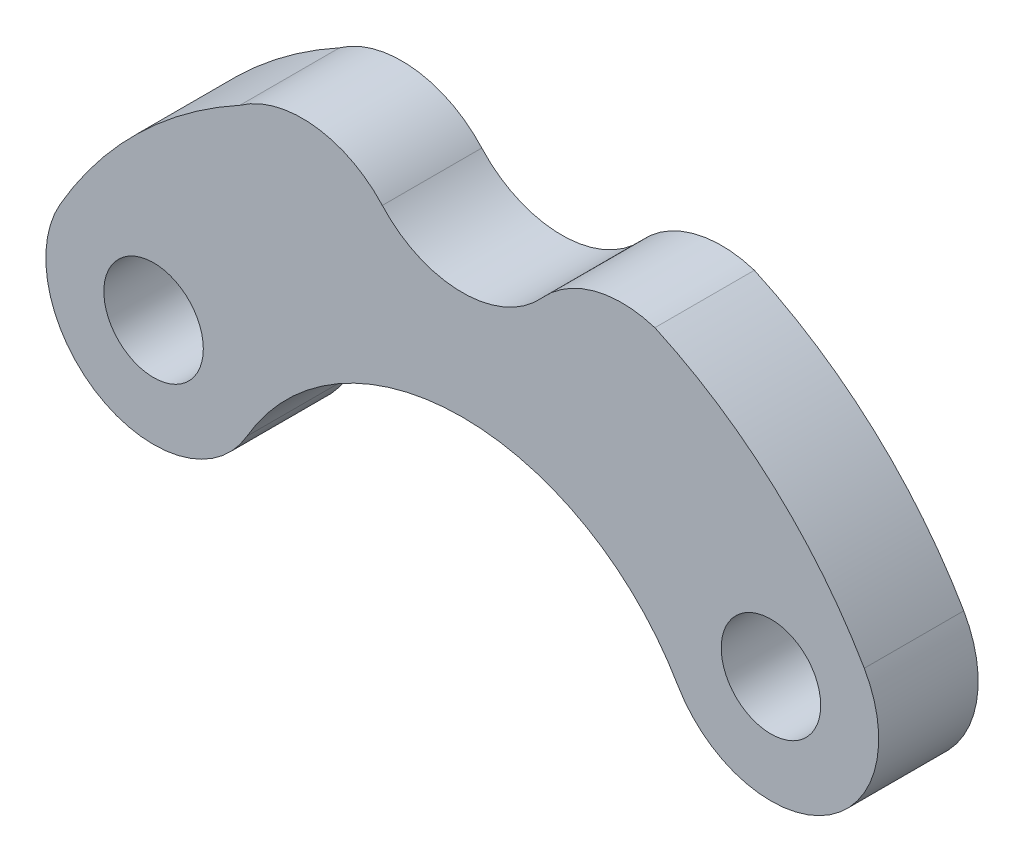
ISO-10303-21;
HEADER;
FILE_DESCRIPTION(('STEP AP214'),'2;1');
FILE_NAME('part.step','',(''),(''),'','','');
FILE_SCHEMA(('AUTOMOTIVE_DESIGN { 1 0 10303 214 1 1 1 1 }'));
ENDSEC;
DATA;
#1=APPLICATION_CONTEXT('core data for automotive mechanical design processes');
#2=APPLICATION_PROTOCOL_DEFINITION('international standard','automotive_design',2000,#1);
#3=PRODUCT_CONTEXT('',#1,'mechanical');
#4=PRODUCT('Part','Part','',(#3));
#5=PRODUCT_RELATED_PRODUCT_CATEGORY('part','',(#4));
#6=PRODUCT_DEFINITION_FORMATION('','',#4);
#7=PRODUCT_DEFINITION_CONTEXT('part definition',#1,'design');
#8=PRODUCT_DEFINITION('design','',#6,#7);
#9=PRODUCT_DEFINITION_SHAPE('','',#8);
#10=(LENGTH_UNIT() NAMED_UNIT(*) SI_UNIT(.MILLI.,.METRE.));
#11=(NAMED_UNIT(*) PLANE_ANGLE_UNIT() SI_UNIT($,.RADIAN.));
#12=(NAMED_UNIT(*) SI_UNIT($,.STERADIAN.) SOLID_ANGLE_UNIT());
#13=UNCERTAINTY_MEASURE_WITH_UNIT(LENGTH_MEASURE(1.E-05),#10,'distance_accuracy_value','');
#14=(GEOMETRIC_REPRESENTATION_CONTEXT(3) GLOBAL_UNCERTAINTY_ASSIGNED_CONTEXT((#13)) GLOBAL_UNIT_ASSIGNED_CONTEXT((#10,
#11,#12)) REPRESENTATION_CONTEXT('',''));
#15=CARTESIAN_POINT('',(0.,0.,0.));
#16=DIRECTION('',(0.,0.,1.));
#17=DIRECTION('',(1.,0.,0.));
#18=AXIS2_PLACEMENT_3D('',#15,#16,#17);
#19=CARTESIAN_POINT('',(-4.65488654534138,2.68749999999995,3.));
#20=DIRECTION('',(0.,0.,1.));
#21=DIRECTION('',(1.,0.,0.));
#22=AXIS2_PLACEMENT_3D('',#19,#20,#21);
#23=PLANE('',#22);
#24=CARTESIAN_POINT('',(9.30977309068262,5.37500000000016,3.));
#25=DIRECTION('',(0.,0.,1.));
#26=DIRECTION('',(1.,0.,0.));
#27=AXIS2_PLACEMENT_3D('',#24,#25,#26);
#28=CIRCLE('',#27,1.5);
#29=CARTESIAN_POINT('',(10.8097730906826,5.37500000000016,3.));
#30=VERTEX_POINT('',#29);
#31=EDGE_CURVE('E134',#30,#30,#28,.T.);
#32=ORIENTED_EDGE('',*,*,#31,.F.);
#33=EDGE_LOOP('',(#32));
#34=FACE_BOUND('',#33,.T.);
#35=CARTESIAN_POINT('',(-9.30977309068277,5.37499999999991,3.));
#36=DIRECTION('',(0.,0.,1.));
#37=DIRECTION('',(1.,0.,0.));
#38=AXIS2_PLACEMENT_3D('',#35,#36,#37);
#39=CIRCLE('',#38,3.25);
#40=CARTESIAN_POINT('',(-12.1243556529822,6.99999999999988,3.));
#41=VERTEX_POINT('',#40);
#42=CARTESIAN_POINT('',(-6.49519052838333,3.74999999999994,3.));
#43=VERTEX_POINT('',#42);
#44=EDGE_CURVE('E145',#41,#43,#39,.T.);
#45=ORIENTED_EDGE('',*,*,#44,.T.);
#46=CARTESIAN_POINT('',(0.,0.,3.));
#47=DIRECTION('',(0.,0.,-1.));
#48=DIRECTION('',(1.,0.,0.));
#49=AXIS2_PLACEMENT_3D('',#46,#47,#48);
#50=CIRCLE('',#49,7.5);
#51=CARTESIAN_POINT('',(6.49519052838322,3.75000000000011,3.));
#52=VERTEX_POINT('',#51);
#53=EDGE_CURVE('E93',#43,#52,#50,.T.);
#54=ORIENTED_EDGE('',*,*,#53,.T.);
#55=CARTESIAN_POINT('',(9.30977309068262,5.37500000000016,3.));
#56=DIRECTION('',(0.,0.,1.));
#57=DIRECTION('',(1.,0.,0.));
#58=AXIS2_PLACEMENT_3D('',#55,#56,#57);
#59=CIRCLE('',#58,3.25);
#60=CARTESIAN_POINT('',(12.124355652982,7.00000000000021,3.));
#61=VERTEX_POINT('',#60);
#62=EDGE_CURVE('E160',#52,#61,#59,.T.);
#63=ORIENTED_EDGE('',*,*,#62,.T.);
#64=CARTESIAN_POINT('',(0.,0.,3.));
#65=DIRECTION('',(0.,0.,1.));
#66=DIRECTION('',(1.,0.,0.));
#67=AXIS2_PLACEMENT_3D('',#64,#65,#66);
#68=CIRCLE('',#67,14.);
#69=CARTESIAN_POINT('',(5.80943087987062,12.7377593340432,3.));
#70=VERTEX_POINT('',#69);
#71=EDGE_CURVE('E173',#61,#70,#68,.T.);
#72=ORIENTED_EDGE('',*,*,#71,.T.);
#73=CARTESIAN_POINT('',(4.82206978136234,9.64137142857136,3.));
#74=DIRECTION('',(0.,0.,1.));
#75=DIRECTION('',(1.,0.,0.));
#76=AXIS2_PLACEMENT_3D('',#73,#74,#75);
#77=CIRCLE('',#76,3.25);
#78=CARTESIAN_POINT('',(2.41103489067909,11.8206857142833,3.));
#79=VERTEX_POINT('',#78);
#80=EDGE_CURVE('E112',#70,#79,#77,.T.);
#81=ORIENTED_EDGE('',*,*,#80,.T.);
#82=CARTESIAN_POINT('',(1.07437023516552E-11,13.9999999999817,3.));
#83=DIRECTION('',(0.,0.,-1.));
#84=DIRECTION('',(1.,0.,0.));
#85=AXIS2_PLACEMENT_3D('',#82,#83,#84);
#86=CIRCLE('',#85,3.24999999997992);
#87=CARTESIAN_POINT('',(-2.41103489066096,11.820685714287,3.));
#88=VERTEX_POINT('',#87);
#89=EDGE_CURVE('E106',#79,#88,#86,.T.);
#90=ORIENTED_EDGE('',*,*,#89,.T.);
#91=CARTESIAN_POINT('',(-4.82206978134755,9.64137142857876,3.));
#92=DIRECTION('',(0.,0.,1.));
#93=DIRECTION('',(1.,0.,0.));
#94=AXIS2_PLACEMENT_3D('',#91,#92,#93);
#95=CIRCLE('',#94,3.25);
#96=CARTESIAN_POINT('',(-6.70737151186402,12.2886601141799,3.));
#97=VERTEX_POINT('',#96);
#98=EDGE_CURVE('E110',#88,#97,#95,.T.);
#99=ORIENTED_EDGE('',*,*,#98,.T.);
#100=CARTESIAN_POINT('',(0.,0.,3.));
#101=DIRECTION('',(0.,0.,1.));
#102=DIRECTION('',(1.,0.,0.));
#103=AXIS2_PLACEMENT_3D('',#100,#101,#102);
#104=CIRCLE('',#103,14.);
#105=EDGE_CURVE('E50',#97,#41,#104,.T.);
#106=ORIENTED_EDGE('',*,*,#105,.T.);
#107=EDGE_LOOP('',(#45,#54,#63,#72,#81,#90,#99,#106));
#108=FACE_BOUND('',#107,.T.);
#109=CARTESIAN_POINT('',(-9.30977309068277,5.37499999999991,3.));
#110=DIRECTION('',(0.,0.,1.));
#111=DIRECTION('',(1.,0.,0.));
#112=AXIS2_PLACEMENT_3D('',#109,#110,#111);
#113=CIRCLE('',#112,1.5);
#114=CARTESIAN_POINT('',(-7.80977309068277,5.37499999999991,3.));
#115=VERTEX_POINT('',#114);
#116=EDGE_CURVE('E182',#115,#115,#113,.T.);
#117=ORIENTED_EDGE('',*,*,#116,.F.);
#118=EDGE_LOOP('',(#117));
#119=FACE_BOUND('',#118,.T.);
#120=ADVANCED_FACE('F33',(#34,#108,#119),#23,.T.);
#121=CARTESIAN_POINT('',(-4.65488654534138,2.68749999999995,0.));
#122=DIRECTION('',(0.,0.,1.));
#123=DIRECTION('',(1.,0.,0.));
#124=AXIS2_PLACEMENT_3D('',#121,#122,#123);
#125=PLANE('',#124);
#126=CARTESIAN_POINT('',(-9.30977309068277,5.37499999999991,0.));
#127=DIRECTION('',(0.,0.,1.));
#128=DIRECTION('',(1.,0.,0.));
#129=AXIS2_PLACEMENT_3D('',#126,#127,#128);
#130=CIRCLE('',#129,3.25);
#131=CARTESIAN_POINT('',(-12.1243556529822,6.99999999999988,0.));
#132=VERTEX_POINT('',#131);
#133=CARTESIAN_POINT('',(-6.49519052838333,3.74999999999994,0.));
#134=VERTEX_POINT('',#133);
#135=EDGE_CURVE('E130',#132,#134,#130,.T.);
#136=ORIENTED_EDGE('',*,*,#135,.F.);
#137=CARTESIAN_POINT('',(0.,0.,0.));
#138=DIRECTION('',(0.,0.,1.));
#139=DIRECTION('',(1.,0.,0.));
#140=AXIS2_PLACEMENT_3D('',#137,#138,#139);
#141=CIRCLE('',#140,14.);
#142=CARTESIAN_POINT('',(-6.70737151186402,12.2886601141799,0.));
#143=VERTEX_POINT('',#142);
#144=EDGE_CURVE('E85',#143,#132,#141,.T.);
#145=ORIENTED_EDGE('',*,*,#144,.F.);
#146=CARTESIAN_POINT('',(-4.82206978134755,9.64137142857876,0.));
#147=DIRECTION('',(0.,0.,1.));
#148=DIRECTION('',(1.,0.,0.));
#149=AXIS2_PLACEMENT_3D('',#146,#147,#148);
#150=CIRCLE('',#149,3.25);
#151=CARTESIAN_POINT('',(-2.41103489066096,11.820685714287,0.));
#152=VERTEX_POINT('',#151);
#153=EDGE_CURVE('E79',#152,#143,#150,.T.);
#154=ORIENTED_EDGE('',*,*,#153,.F.);
#155=CARTESIAN_POINT('',(1.07437023516552E-11,13.9999999999817,0.));
#156=DIRECTION('',(0.,0.,-1.));
#157=DIRECTION('',(1.,0.,0.));
#158=AXIS2_PLACEMENT_3D('',#155,#156,#157);
#159=CIRCLE('',#158,3.24999999997992);
#160=CARTESIAN_POINT('',(2.41103489067909,11.8206857142833,0.));
#161=VERTEX_POINT('',#160);
#162=EDGE_CURVE('E120',#161,#152,#159,.T.);
#163=ORIENTED_EDGE('',*,*,#162,.F.);
#164=CARTESIAN_POINT('',(4.82206978136234,9.64137142857136,0.));
#165=DIRECTION('',(0.,0.,1.));
#166=DIRECTION('',(1.,0.,0.));
#167=AXIS2_PLACEMENT_3D('',#164,#165,#166);
#168=CIRCLE('',#167,3.25);
#169=CARTESIAN_POINT('',(5.80943087987062,12.7377593340432,0.));
#170=VERTEX_POINT('',#169);
#171=EDGE_CURVE('E140',#170,#161,#168,.T.);
#172=ORIENTED_EDGE('',*,*,#171,.F.);
#173=CARTESIAN_POINT('',(0.,0.,0.));
#174=DIRECTION('',(0.,0.,1.));
#175=DIRECTION('',(1.,0.,0.));
#176=AXIS2_PLACEMENT_3D('',#173,#174,#175);
#177=CIRCLE('',#176,14.);
#178=CARTESIAN_POINT('',(12.124355652982,7.00000000000021,0.));
#179=VERTEX_POINT('',#178);
#180=EDGE_CURVE('E138',#179,#170,#177,.T.);
#181=ORIENTED_EDGE('',*,*,#180,.F.);
#182=CARTESIAN_POINT('',(9.30977309068262,5.37500000000016,0.));
#183=DIRECTION('',(0.,0.,1.));
#184=DIRECTION('',(1.,0.,0.));
#185=AXIS2_PLACEMENT_3D('',#182,#183,#184);
#186=CIRCLE('',#185,3.25);
#187=CARTESIAN_POINT('',(6.49519052838322,3.75000000000011,0.));
#188=VERTEX_POINT('',#187);
#189=EDGE_CURVE('E136',#188,#179,#186,.T.);
#190=ORIENTED_EDGE('',*,*,#189,.F.);
#191=CARTESIAN_POINT('',(0.,0.,0.));
#192=DIRECTION('',(0.,0.,-1.));
#193=DIRECTION('',(1.,0.,0.));
#194=AXIS2_PLACEMENT_3D('',#191,#192,#193);
#195=CIRCLE('',#194,7.5);
#196=EDGE_CURVE('E133',#134,#188,#195,.T.);
#197=ORIENTED_EDGE('',*,*,#196,.F.);
#198=EDGE_LOOP('',(#136,#145,#154,#163,#172,#181,#190,#197));
#199=FACE_BOUND('',#198,.T.);
#200=CARTESIAN_POINT('',(9.30977309068262,5.37500000000016,0.));
#201=DIRECTION('',(0.,0.,1.));
#202=DIRECTION('',(1.,0.,0.));
#203=AXIS2_PLACEMENT_3D('',#200,#201,#202);
#204=CIRCLE('',#203,1.5);
#205=CARTESIAN_POINT('',(10.8097730906826,5.37500000000016,0.));
#206=VERTEX_POINT('',#205);
#207=EDGE_CURVE('E179',#206,#206,#204,.T.);
#208=ORIENTED_EDGE('',*,*,#207,.T.);
#209=EDGE_LOOP('',(#208));
#210=FACE_BOUND('',#209,.T.);
#211=CARTESIAN_POINT('',(-9.30977309068277,5.37499999999991,0.));
#212=DIRECTION('',(0.,0.,1.));
#213=DIRECTION('',(1.,0.,0.));
#214=AXIS2_PLACEMENT_3D('',#211,#212,#213);
#215=CIRCLE('',#214,1.5);
#216=CARTESIAN_POINT('',(-7.80977309068277,5.37499999999991,0.));
#217=VERTEX_POINT('',#216);
#218=EDGE_CURVE('E185',#217,#217,#215,.T.);
#219=ORIENTED_EDGE('',*,*,#218,.T.);
#220=EDGE_LOOP('',(#219));
#221=FACE_BOUND('',#220,.T.);
#222=ADVANCED_FACE('F164',(#199,#210,#221),#125,.F.);
#223=CARTESIAN_POINT('',(-9.30977309068277,5.37499999999991,3.));
#224=DIRECTION('',(0.,0.,-1.));
#225=DIRECTION('',(-1.,0.,0.));
#226=AXIS2_PLACEMENT_3D('',#223,#224,#225);
#227=CYLINDRICAL_SURFACE('',#226,3.25);
#228=ORIENTED_EDGE('',*,*,#135,.T.);
#229=DIRECTION('',(0.,0.,-1.));
#230=VECTOR('',#229,1.);
#231=CARTESIAN_POINT('',(-6.49519052838333,3.74999999999994,3.));
#232=LINE('',#231,#230);
#233=EDGE_CURVE('E11',#43,#134,#232,.T.);
#234=ORIENTED_EDGE('',*,*,#233,.F.);
#235=ORIENTED_EDGE('',*,*,#44,.F.);
#236=DIRECTION('',(0.,0.,-1.));
#237=VECTOR('',#236,1.);
#238=CARTESIAN_POINT('',(-12.1243556529822,6.99999999999988,3.));
#239=LINE('',#238,#237);
#240=EDGE_CURVE('E126',#41,#132,#239,.T.);
#241=ORIENTED_EDGE('',*,*,#240,.T.);
#242=EDGE_LOOP('',(#228,#234,#235,#241));
#243=FACE_BOUND('',#242,.T.);
#244=ADVANCED_FACE('F35',(#243),#227,.T.);
#245=CARTESIAN_POINT('',(0.,0.,3.));
#246=DIRECTION('',(0.,0.,-1.));
#247=DIRECTION('',(-1.,0.,0.));
#248=AXIS2_PLACEMENT_3D('',#245,#246,#247);
#249=CYLINDRICAL_SURFACE('',#248,7.5);
#250=ORIENTED_EDGE('',*,*,#196,.T.);
#251=DIRECTION('',(0.,0.,-1.));
#252=VECTOR('',#251,1.);
#253=CARTESIAN_POINT('',(6.49519052838322,3.75000000000011,3.));
#254=LINE('',#253,#252);
#255=EDGE_CURVE('E42',#52,#188,#254,.T.);
#256=ORIENTED_EDGE('',*,*,#255,.F.);
#257=ORIENTED_EDGE('',*,*,#53,.F.);
#258=ORIENTED_EDGE('',*,*,#233,.T.);
#259=EDGE_LOOP('',(#250,#256,#257,#258));
#260=FACE_BOUND('',#259,.T.);
#261=ADVANCED_FACE('F217',(#260),#249,.F.);
#262=CARTESIAN_POINT('',(9.30977309068262,5.37500000000016,3.));
#263=DIRECTION('',(0.,0.,-1.));
#264=DIRECTION('',(-1.,0.,0.));
#265=AXIS2_PLACEMENT_3D('',#262,#263,#264);
#266=CYLINDRICAL_SURFACE('',#265,3.25);
#267=ORIENTED_EDGE('',*,*,#189,.T.);
#268=DIRECTION('',(0.,0.,-1.));
#269=VECTOR('',#268,1.);
#270=CARTESIAN_POINT('',(12.124355652982,7.00000000000021,3.));
#271=LINE('',#270,#269);
#272=EDGE_CURVE('E152',#61,#179,#271,.T.);
#273=ORIENTED_EDGE('',*,*,#272,.F.);
#274=ORIENTED_EDGE('',*,*,#62,.F.);
#275=ORIENTED_EDGE('',*,*,#255,.T.);
#276=EDGE_LOOP('',(#267,#273,#274,#275));
#277=FACE_BOUND('',#276,.T.);
#278=ADVANCED_FACE('F158',(#277),#266,.T.);
#279=CARTESIAN_POINT('',(0.,0.,3.));
#280=DIRECTION('',(0.,0.,-1.));
#281=DIRECTION('',(-1.,0.,0.));
#282=AXIS2_PLACEMENT_3D('',#279,#280,#281);
#283=CYLINDRICAL_SURFACE('',#282,14.);
#284=ORIENTED_EDGE('',*,*,#180,.T.);
#285=DIRECTION('',(0.,0.,-1.));
#286=VECTOR('',#285,1.);
#287=CARTESIAN_POINT('',(5.80943087987062,12.7377593340432,3.));
#288=LINE('',#287,#286);
#289=EDGE_CURVE('E149',#70,#170,#288,.T.);
#290=ORIENTED_EDGE('',*,*,#289,.F.);
#291=ORIENTED_EDGE('',*,*,#71,.F.);
#292=ORIENTED_EDGE('',*,*,#272,.T.);
#293=EDGE_LOOP('',(#284,#290,#291,#292));
#294=FACE_BOUND('',#293,.T.);
#295=ADVANCED_FACE('F169',(#294),#283,.T.);
#296=CARTESIAN_POINT('',(4.82206978136234,9.64137142857136,3.));
#297=DIRECTION('',(0.,0.,-1.));
#298=DIRECTION('',(-1.,0.,0.));
#299=AXIS2_PLACEMENT_3D('',#296,#297,#298);
#300=CYLINDRICAL_SURFACE('',#299,3.25);
#301=ORIENTED_EDGE('',*,*,#171,.T.);
#302=DIRECTION('',(0.,0.,-1.));
#303=VECTOR('',#302,1.);
#304=CARTESIAN_POINT('',(2.41103489067909,11.8206857142833,3.));
#305=LINE('',#304,#303);
#306=EDGE_CURVE('E121',#79,#161,#305,.T.);
#307=ORIENTED_EDGE('',*,*,#306,.F.);
#308=ORIENTED_EDGE('',*,*,#80,.F.);
#309=ORIENTED_EDGE('',*,*,#289,.T.);
#310=EDGE_LOOP('',(#301,#307,#308,#309));
#311=FACE_BOUND('',#310,.T.);
#312=ADVANCED_FACE('F172',(#311),#300,.T.);
#313=CARTESIAN_POINT('',(1.07437023516552E-11,13.9999999999817,3.));
#314=DIRECTION('',(0.,0.,-1.));
#315=DIRECTION('',(-1.,0.,0.));
#316=AXIS2_PLACEMENT_3D('',#313,#314,#315);
#317=CYLINDRICAL_SURFACE('',#316,3.24999999997992);
#318=ORIENTED_EDGE('',*,*,#162,.T.);
#319=DIRECTION('',(0.,0.,-1.));
#320=VECTOR('',#319,1.);
#321=CARTESIAN_POINT('',(-2.41103489066096,11.820685714287,3.));
#322=LINE('',#321,#320);
#323=EDGE_CURVE('E117',#88,#152,#322,.T.);
#324=ORIENTED_EDGE('',*,*,#323,.F.);
#325=ORIENTED_EDGE('',*,*,#89,.F.);
#326=ORIENTED_EDGE('',*,*,#306,.T.);
#327=EDGE_LOOP('',(#318,#324,#325,#326));
#328=FACE_BOUND('',#327,.T.);
#329=ADVANCED_FACE('F118',(#328),#317,.F.);
#330=CARTESIAN_POINT('',(-4.82206978134755,9.64137142857876,3.));
#331=DIRECTION('',(0.,0.,-1.));
#332=DIRECTION('',(-1.,0.,0.));
#333=AXIS2_PLACEMENT_3D('',#330,#331,#332);
#334=CYLINDRICAL_SURFACE('',#333,3.25);
#335=ORIENTED_EDGE('',*,*,#153,.T.);
#336=DIRECTION('',(0.,0.,-1.));
#337=VECTOR('',#336,1.);
#338=CARTESIAN_POINT('',(-6.70737151186402,12.2886601141799,3.));
#339=LINE('',#338,#337);
#340=EDGE_CURVE('E122',#97,#143,#339,.T.);
#341=ORIENTED_EDGE('',*,*,#340,.F.);
#342=ORIENTED_EDGE('',*,*,#98,.F.);
#343=ORIENTED_EDGE('',*,*,#323,.T.);
#344=EDGE_LOOP('',(#335,#341,#342,#343));
#345=FACE_BOUND('',#344,.T.);
#346=ADVANCED_FACE('F124',(#345),#334,.T.);
#347=CARTESIAN_POINT('',(0.,0.,3.));
#348=DIRECTION('',(0.,0.,-1.));
#349=DIRECTION('',(-1.,0.,0.));
#350=AXIS2_PLACEMENT_3D('',#347,#348,#349);
#351=CYLINDRICAL_SURFACE('',#350,14.);
#352=ORIENTED_EDGE('',*,*,#144,.T.);
#353=ORIENTED_EDGE('',*,*,#240,.F.);
#354=ORIENTED_EDGE('',*,*,#105,.F.);
#355=ORIENTED_EDGE('',*,*,#340,.T.);
#356=EDGE_LOOP('',(#352,#353,#354,#355));
#357=FACE_BOUND('',#356,.T.);
#358=ADVANCED_FACE('F205',(#357),#351,.T.);
#359=CARTESIAN_POINT('',(9.30977309068262,5.37500000000016,3.));
#360=DIRECTION('',(0.,0.,-1.));
#361=DIRECTION('',(-1.,0.,0.));
#362=AXIS2_PLACEMENT_3D('',#359,#360,#361);
#363=CYLINDRICAL_SURFACE('',#362,1.5);
#364=ORIENTED_EDGE('',*,*,#31,.T.);
#365=EDGE_LOOP('',(#364));
#366=FACE_BOUND('',#365,.T.);
#367=ORIENTED_EDGE('',*,*,#207,.F.);
#368=EDGE_LOOP('',(#367));
#369=FACE_BOUND('',#368,.T.);
#370=ADVANCED_FACE('F202',(#366,#369),#363,.F.);
#371=CARTESIAN_POINT('',(-9.30977309068277,5.37499999999991,3.));
#372=DIRECTION('',(0.,0.,-1.));
#373=DIRECTION('',(-1.,0.,0.));
#374=AXIS2_PLACEMENT_3D('',#371,#372,#373);
#375=CYLINDRICAL_SURFACE('',#374,1.5);
#376=ORIENTED_EDGE('',*,*,#116,.T.);
#377=EDGE_LOOP('',(#376));
#378=FACE_BOUND('',#377,.T.);
#379=ORIENTED_EDGE('',*,*,#218,.F.);
#380=EDGE_LOOP('',(#379));
#381=FACE_BOUND('',#380,.T.);
#382=ADVANCED_FACE('F191',(#378,#381),#375,.F.);
#383=CLOSED_SHELL('',(#120,#222,#244,#261,#278,#295,#312,#329,#346,#358,#370,#382));
#384=MANIFOLD_SOLID_BREP('B2',#383);
#385=ADVANCED_BREP_SHAPE_REPRESENTATION('',(#18,#384),#14);
#386=SHAPE_DEFINITION_REPRESENTATION(#9,#385);
ENDSEC;
END-ISO-10303-21;
